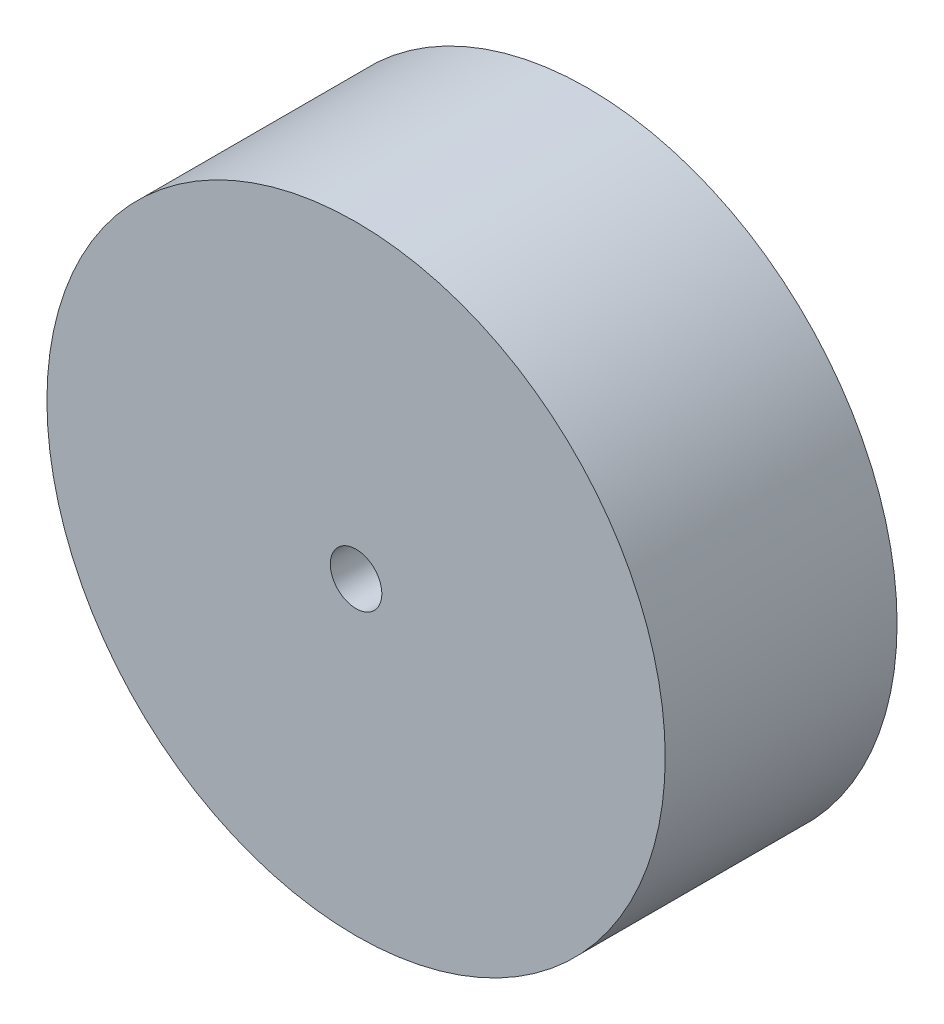
ISO-10303-21;
HEADER;
FILE_DESCRIPTION(('STEP AP214'),'2;1');
FILE_NAME('part.step','',(''),(''),'','','');
FILE_SCHEMA(('AUTOMOTIVE_DESIGN { 1 0 10303 214 1 1 1 1 }'));
ENDSEC;
DATA;
#1=APPLICATION_CONTEXT('core data for automotive mechanical design processes');
#2=APPLICATION_PROTOCOL_DEFINITION('international standard','automotive_design',2000,#1);
#3=PRODUCT_CONTEXT('',#1,'mechanical');
#4=PRODUCT('Part','Part','',(#3));
#5=PRODUCT_RELATED_PRODUCT_CATEGORY('part','',(#4));
#6=PRODUCT_DEFINITION_FORMATION('','',#4);
#7=PRODUCT_DEFINITION_CONTEXT('part definition',#1,'design');
#8=PRODUCT_DEFINITION('design','',#6,#7);
#9=PRODUCT_DEFINITION_SHAPE('','',#8);
#10=(LENGTH_UNIT() NAMED_UNIT(*) SI_UNIT(.MILLI.,.METRE.));
#11=(NAMED_UNIT(*) PLANE_ANGLE_UNIT() SI_UNIT($,.RADIAN.));
#12=(NAMED_UNIT(*) SI_UNIT($,.STERADIAN.) SOLID_ANGLE_UNIT());
#13=UNCERTAINTY_MEASURE_WITH_UNIT(LENGTH_MEASURE(1.E-05),#10,'distance_accuracy_value','');
#14=(GEOMETRIC_REPRESENTATION_CONTEXT(3) GLOBAL_UNCERTAINTY_ASSIGNED_CONTEXT((#13)) GLOBAL_UNIT_ASSIGNED_CONTEXT((#10,
#11,#12)) REPRESENTATION_CONTEXT('',''));
#15=CARTESIAN_POINT('',(0.,0.,0.));
#16=DIRECTION('',(0.,0.,1.));
#17=DIRECTION('',(1.,0.,0.));
#18=AXIS2_PLACEMENT_3D('',#15,#16,#17);
#19=CARTESIAN_POINT('',(0.,0.,27.));
#20=DIRECTION('',(0.,0.,-1.));
#21=DIRECTION('',(-1.,0.,0.));
#22=AXIS2_PLACEMENT_3D('',#19,#20,#21);
#23=CYLINDRICAL_SURFACE('',#22,36.);
#24=CARTESIAN_POINT('',(0.,0.,27.));
#25=DIRECTION('',(0.,0.,1.));
#26=DIRECTION('',(1.,0.,0.));
#27=AXIS2_PLACEMENT_3D('',#24,#25,#26);
#28=CIRCLE('',#27,36.);
#29=CARTESIAN_POINT('',(36.,0.,27.));
#30=VERTEX_POINT('',#29);
#31=EDGE_CURVE('E10',#30,#30,#28,.T.);
#32=ORIENTED_EDGE('',*,*,#31,.F.);
#33=EDGE_LOOP('',(#32));
#34=FACE_BOUND('',#33,.T.);
#35=CARTESIAN_POINT('',(0.,0.,0.));
#36=DIRECTION('',(0.,0.,1.));
#37=DIRECTION('',(1.,0.,0.));
#38=AXIS2_PLACEMENT_3D('',#35,#36,#37);
#39=CIRCLE('',#38,36.);
#40=CARTESIAN_POINT('',(36.,0.,0.));
#41=VERTEX_POINT('',#40);
#42=EDGE_CURVE('E34',#41,#41,#39,.T.);
#43=ORIENTED_EDGE('',*,*,#42,.T.);
#44=EDGE_LOOP('',(#43));
#45=FACE_BOUND('',#44,.T.);
#46=ADVANCED_FACE('F31',(#34,#45),#23,.T.);
#47=CARTESIAN_POINT('',(0.,0.,27.));
#48=DIRECTION('',(0.,0.,1.));
#49=DIRECTION('',(1.,0.,0.));
#50=AXIS2_PLACEMENT_3D('',#47,#48,#49);
#51=PLANE('',#50);
#52=CARTESIAN_POINT('',(0.,0.,27.));
#53=DIRECTION('',(0.,0.,1.));
#54=DIRECTION('',(1.,0.,0.));
#55=AXIS2_PLACEMENT_3D('',#52,#53,#54);
#56=CIRCLE('',#55,3.);
#57=CARTESIAN_POINT('',(3.,0.,27.));
#58=VERTEX_POINT('',#57);
#59=EDGE_CURVE('E43',#58,#58,#56,.T.);
#60=ORIENTED_EDGE('',*,*,#59,.F.);
#61=EDGE_LOOP('',(#60));
#62=FACE_BOUND('',#61,.T.);
#63=ORIENTED_EDGE('',*,*,#31,.T.);
#64=EDGE_LOOP('',(#63));
#65=FACE_BOUND('',#64,.T.);
#66=ADVANCED_FACE('F58',(#62,#65),#51,.T.);
#67=CARTESIAN_POINT('',(0.,0.,0.));
#68=DIRECTION('',(0.,0.,1.));
#69=DIRECTION('',(1.,0.,0.));
#70=AXIS2_PLACEMENT_3D('',#67,#68,#69);
#71=PLANE('',#70);
#72=CARTESIAN_POINT('',(0.,0.,0.));
#73=DIRECTION('',(0.,0.,1.));
#74=DIRECTION('',(1.,0.,0.));
#75=AXIS2_PLACEMENT_3D('',#72,#73,#74);
#76=CIRCLE('',#75,3.);
#77=CARTESIAN_POINT('',(3.,0.,0.));
#78=VERTEX_POINT('',#77);
#79=EDGE_CURVE('E41',#78,#78,#76,.T.);
#80=ORIENTED_EDGE('',*,*,#79,.T.);
#81=EDGE_LOOP('',(#80));
#82=FACE_BOUND('',#81,.T.);
#83=ORIENTED_EDGE('',*,*,#42,.F.);
#84=EDGE_LOOP('',(#83));
#85=FACE_BOUND('',#84,.T.);
#86=ADVANCED_FACE('F49',(#82,#85),#71,.F.);
#87=CARTESIAN_POINT('',(0.,0.,0.));
#88=DIRECTION('',(0.,0.,1.));
#89=DIRECTION('',(1.,0.,0.));
#90=AXIS2_PLACEMENT_3D('',#87,#88,#89);
#91=CYLINDRICAL_SURFACE('',#90,3.);
#92=ORIENTED_EDGE('',*,*,#79,.F.);
#93=EDGE_LOOP('',(#92));
#94=FACE_BOUND('',#93,.T.);
#95=ORIENTED_EDGE('',*,*,#59,.T.);
#96=EDGE_LOOP('',(#95));
#97=FACE_BOUND('',#96,.T.);
#98=ADVANCED_FACE('F52',(#94,#97),#91,.F.);
#99=CLOSED_SHELL('',(#46,#66,#86,#98));
#100=MANIFOLD_SOLID_BREP('B2',#99);
#101=ADVANCED_BREP_SHAPE_REPRESENTATION('',(#18,#100),#14);
#102=SHAPE_DEFINITION_REPRESENTATION(#9,#101);
ENDSEC;
END-ISO-10303-21;
